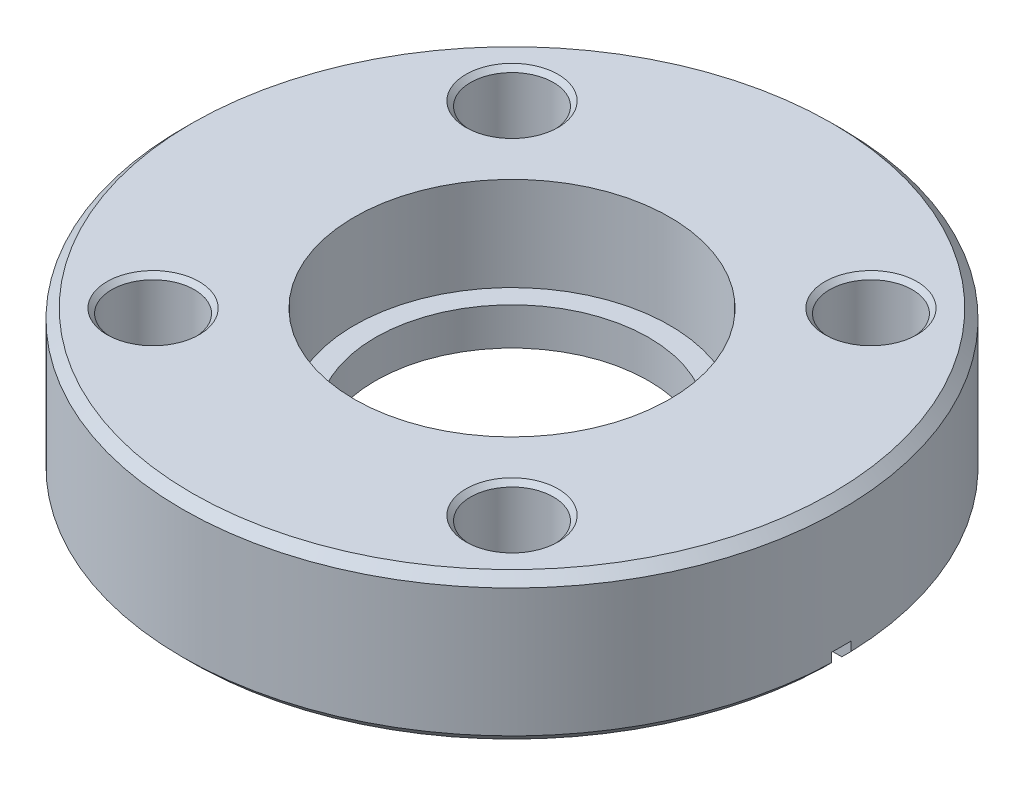
ISO-10303-21;
HEADER;
FILE_DESCRIPTION(('STEP AP214'),'2;1');
FILE_NAME('part.step','',(''),(''),'','','');
FILE_SCHEMA(('AUTOMOTIVE_DESIGN { 1 0 10303 214 1 1 1 1 }'));
ENDSEC;
DATA;
#1=APPLICATION_CONTEXT('core data for automotive mechanical design processes');
#2=APPLICATION_PROTOCOL_DEFINITION('international standard','automotive_design',2000,#1);
#3=PRODUCT_CONTEXT('',#1,'mechanical');
#4=PRODUCT('Part','Part','',(#3));
#5=PRODUCT_RELATED_PRODUCT_CATEGORY('part','',(#4));
#6=PRODUCT_DEFINITION_FORMATION('','',#4);
#7=PRODUCT_DEFINITION_CONTEXT('part definition',#1,'design');
#8=PRODUCT_DEFINITION('design','',#6,#7);
#9=PRODUCT_DEFINITION_SHAPE('','',#8);
#10=(LENGTH_UNIT() NAMED_UNIT(*) SI_UNIT(.MILLI.,.METRE.));
#11=(NAMED_UNIT(*) PLANE_ANGLE_UNIT() SI_UNIT($,.RADIAN.));
#12=(NAMED_UNIT(*) SI_UNIT($,.STERADIAN.) SOLID_ANGLE_UNIT());
#13=UNCERTAINTY_MEASURE_WITH_UNIT(LENGTH_MEASURE(1.E-05),#10,'distance_accuracy_value','');
#14=(GEOMETRIC_REPRESENTATION_CONTEXT(3) GLOBAL_UNCERTAINTY_ASSIGNED_CONTEXT((#13)) GLOBAL_UNIT_ASSIGNED_CONTEXT((#10,
#11,#12)) REPRESENTATION_CONTEXT('',''));
#15=CARTESIAN_POINT('',(0.,0.,0.));
#16=DIRECTION('',(0.,0.,1.));
#17=DIRECTION('',(1.,0.,0.));
#18=AXIS2_PLACEMENT_3D('',#15,#16,#17);
#19=CARTESIAN_POINT('',(0.,0.,0.));
#20=DIRECTION('',(0.,1.,0.));
#21=DIRECTION('',(0.,0.,1.));
#22=AXIS2_PLACEMENT_3D('',#19,#20,#21);
#23=PLANE('',#22);
#24=CARTESIAN_POINT('',(14.5929161967373,0.,-14.5929161967374));
#25=DIRECTION('',(0.,1.,0.));
#26=DIRECTION('',(0.,0.,1.));
#27=AXIS2_PLACEMENT_3D('',#24,#25,#26);
#28=CIRCLE('',#27,3.74649999999998);
#29=CARTESIAN_POINT('',(14.5929161967373,0.,-10.8464161967374));
#30=VERTEX_POINT('',#29);
#31=EDGE_CURVE('E154',#30,#30,#28,.T.);
#32=ORIENTED_EDGE('',*,*,#31,.T.);
#33=EDGE_LOOP('',(#32));
#34=FACE_BOUND('',#33,.T.);
#35=CARTESIAN_POINT('',(-14.5929161967372,0.,-14.5929161967375));
#36=DIRECTION('',(0.,1.,0.));
#37=DIRECTION('',(0.,0.,1.));
#38=AXIS2_PLACEMENT_3D('',#35,#36,#37);
#39=CIRCLE('',#38,3.74649999999998);
#40=CARTESIAN_POINT('',(-14.5929161967372,0.,-10.8464161967375));
#41=VERTEX_POINT('',#40);
#42=EDGE_CURVE('E190',#41,#41,#39,.T.);
#43=ORIENTED_EDGE('',*,*,#42,.T.);
#44=EDGE_LOOP('',(#43));
#45=FACE_BOUND('',#44,.T.);
#46=DIRECTION('',(-1.,0.,0.));
#47=VECTOR('',#46,1.);
#48=CARTESIAN_POINT('',(28.575,0.,-0.79375));
#49=LINE('',#48,#47);
#50=CARTESIAN_POINT('',(26.0228973394105,0.,-0.79375));
#51=VERTEX_POINT('',#50);
#52=CARTESIAN_POINT('',(16.4909084327547,0.,-0.79375));
#53=VERTEX_POINT('',#52);
#54=EDGE_CURVE('E216',#51,#53,#49,.T.);
#55=ORIENTED_EDGE('',*,*,#54,.T.);
#56=CARTESIAN_POINT('',(0.,0.,0.));
#57=DIRECTION('',(0.,1.,0.));
#58=DIRECTION('',(0.,0.,1.));
#59=AXIS2_PLACEMENT_3D('',#56,#57,#58);
#60=CIRCLE('',#59,16.51);
#61=CARTESIAN_POINT('',(-16.4909084327547,0.,-0.79375));
#62=VERTEX_POINT('',#61);
#63=EDGE_CURVE('E221',#53,#62,#60,.T.);
#64=ORIENTED_EDGE('',*,*,#63,.T.);
#65=DIRECTION('',(1.,0.,0.));
#66=VECTOR('',#65,1.);
#67=CARTESIAN_POINT('',(-28.575,0.,-0.79375));
#68=LINE('',#67,#66);
#69=CARTESIAN_POINT('',(-26.0228973394105,0.,-0.79375));
#70=VERTEX_POINT('',#69);
#71=EDGE_CURVE('E295',#70,#62,#68,.T.);
#72=ORIENTED_EDGE('',*,*,#71,.F.);
#73=CARTESIAN_POINT('',(0.,0.,0.));
#74=DIRECTION('',(0.,1.,0.));
#75=DIRECTION('',(0.,0.,1.));
#76=AXIS2_PLACEMENT_3D('',#73,#74,#75);
#77=CIRCLE('',#76,26.035);
#78=EDGE_CURVE('E131',#70,#51,#77,.F.);
#79=ORIENTED_EDGE('',*,*,#78,.T.);
#80=EDGE_LOOP('',(#55,#64,#72,#79));
#81=FACE_BOUND('',#80,.T.);
#82=ADVANCED_FACE('F33',(#34,#45,#81),#23,.F.);
#83=CARTESIAN_POINT('',(0.,11.938,0.));
#84=DIRECTION('',(0.,-1.,0.));
#85=DIRECTION('',(0.,0.,-1.));
#86=AXIS2_PLACEMENT_3D('',#83,#84,#85);
#87=CYLINDRICAL_SURFACE('',#86,26.797);
#88=CARTESIAN_POINT('',(0.,11.176,0.));
#89=DIRECTION('',(0.,1.,0.));
#90=DIRECTION('',(0.,0.,1.));
#91=AXIS2_PLACEMENT_3D('',#88,#89,#90);
#92=CIRCLE('',#91,26.797);
#93=CARTESIAN_POINT('',(0.,11.176,26.797));
#94=VERTEX_POINT('',#93);
#95=EDGE_CURVE('E132',#94,#94,#92,.F.);
#96=ORIENTED_EDGE('',*,*,#95,.T.);
#97=EDGE_LOOP('',(#96));
#98=FACE_BOUND('',#97,.T.);
#99=DIRECTION('',(0.,-1.,0.));
#100=VECTOR('',#99,1.);
#101=CARTESIAN_POINT('',(26.7852416441872,11.938,-0.79375));
#102=LINE('',#101,#100);
#103=CARTESIAN_POINT('',(26.7852416441872,0.762000000000009,-0.79375));
#104=VERTEX_POINT('',#103);
#105=CARTESIAN_POINT('',(26.7852416441872,1.5037550321313,-0.79375));
#106=VERTEX_POINT('',#105);
#107=EDGE_CURVE('E215',#104,#106,#102,.F.);
#108=ORIENTED_EDGE('',*,*,#107,.F.);
#109=CARTESIAN_POINT('',(0.,0.762000000000009,0.));
#110=DIRECTION('',(0.,1.,0.));
#111=DIRECTION('',(0.,0.,1.));
#112=AXIS2_PLACEMENT_3D('',#109,#110,#111);
#113=CIRCLE('',#112,26.797);
#114=CARTESIAN_POINT('',(-26.7852416441872,0.762000000000009,-0.79375));
#115=VERTEX_POINT('',#114);
#116=EDGE_CURVE('E250',#104,#115,#113,.T.);
#117=ORIENTED_EDGE('',*,*,#116,.T.);
#118=DIRECTION('',(0.,-1.,0.));
#119=VECTOR('',#118,1.);
#120=CARTESIAN_POINT('',(-26.7852416441872,11.938,-0.79375));
#121=LINE('',#120,#119);
#122=CARTESIAN_POINT('',(-26.7852416441872,1.5037550321313,-0.79375));
#123=VERTEX_POINT('',#122);
#124=EDGE_CURVE('E229',#123,#115,#121,.T.);
#125=ORIENTED_EDGE('',*,*,#124,.F.);
#126=CARTESIAN_POINT('',(0.,0.100000000000001,0.));
#127=DIRECTION('',(0.0523359562429369,0.998629534754574,0.));
#128=DIRECTION('',(0.998629534754574,-0.0523359562429369,0.));
#129=AXIS2_PLACEMENT_3D('',#126,#127,#128);
#130=ELLIPSE('',#129,26.8337747557063,26.797);
#131=CARTESIAN_POINT('',(-26.7852416441872,1.5037550321313,0.79375));
#132=VERTEX_POINT('',#131);
#133=EDGE_CURVE('E225',#123,#132,#130,.T.);
#134=ORIENTED_EDGE('',*,*,#133,.T.);
#135=DIRECTION('',(0.,-1.,0.));
#136=VECTOR('',#135,1.);
#137=CARTESIAN_POINT('',(-26.7852416441872,11.938,0.79375));
#138=LINE('',#137,#136);
#139=CARTESIAN_POINT('',(-26.7852416441872,0.762000000000009,0.79375));
#140=VERTEX_POINT('',#139);
#141=EDGE_CURVE('E268',#132,#140,#138,.T.);
#142=ORIENTED_EDGE('',*,*,#141,.T.);
#143=CARTESIAN_POINT('',(26.7852416441872,0.762000000000009,0.79375));
#144=VERTEX_POINT('',#143);
#145=EDGE_CURVE('E137',#140,#144,#113,.T.);
#146=ORIENTED_EDGE('',*,*,#145,.T.);
#147=DIRECTION('',(0.,-1.,0.));
#148=VECTOR('',#147,1.);
#149=CARTESIAN_POINT('',(26.7852416441872,11.938,0.79375));
#150=LINE('',#149,#148);
#151=CARTESIAN_POINT('',(26.7852416441872,1.5037550321313,0.79375));
#152=VERTEX_POINT('',#151);
#153=EDGE_CURVE('E111',#144,#152,#150,.F.);
#154=ORIENTED_EDGE('',*,*,#153,.T.);
#155=CARTESIAN_POINT('',(0.,0.100000000000001,0.));
#156=DIRECTION('',(0.0523359562429369,-0.998629534754574,0.));
#157=DIRECTION('',(-0.998629534754574,-0.0523359562429369,0.));
#158=AXIS2_PLACEMENT_3D('',#155,#156,#157);
#159=ELLIPSE('',#158,26.8337747557063,26.797);
#160=EDGE_CURVE('E299',#106,#152,#159,.T.);
#161=ORIENTED_EDGE('',*,*,#160,.F.);
#162=EDGE_LOOP('',(#108,#117,#125,#134,#142,#146,#154,#161));
#163=FACE_BOUND('',#162,.T.);
#164=ADVANCED_FACE('F256',(#98,#163),#87,.T.);
#165=CARTESIAN_POINT('',(0.,0.762000000000009,0.));
#166=DIRECTION('',(0.,1.,0.));
#167=DIRECTION('',(0.,0.,1.));
#168=AXIS2_PLACEMENT_3D('',#165,#166,#167);
#169=CONICAL_SURFACE('',#168,26.797,0.785398163397448);
#170=ORIENTED_EDGE('',*,*,#116,.F.);
#171=CARTESIAN_POINT('',(39.9149252456313,13.8878167396395,-0.79375));
#172=CARTESIAN_POINT('',(37.582159761859,11.5555440292699,-0.79375));
#173=CARTESIAN_POINT('',(35.2493822391249,9.22328334262406,-0.79375));
#174=CARTESIAN_POINT('',(30.5836763697181,4.55891299162924,-0.79375));
#175=CARTESIAN_POINT('',(28.2507480230503,2.22680332727534,-0.79375));
#176=CARTESIAN_POINT('',(24.7511471509542,-1.2711528459973,-0.79375));
#177=CARTESIAN_POINT('',(23.5845787714105,-2.43710354668637,-0.79375));
#178=CARTESIAN_POINT('',(21.2513297124667,-4.76889255459092,-0.79375));
#179=CARTESIAN_POINT('',(20.0846490330679,-5.93473086180759,-0.79375));
#180=CARTESIAN_POINT('',(17.7511055469923,-8.26622530435412,-0.79375));
#181=CARTESIAN_POINT('',(16.5842427403078,-9.4318814396762,-0.79375));
#182=CARTESIAN_POINT('',(14.8336959470664,-11.1801127807525,-0.79375));
#183=CARTESIAN_POINT('',(14.2501382417058,-11.7628144278514,-0.79375));
#184=CARTESIAN_POINT('',(13.0828952616553,-12.9280899562256,-0.79375));
#185=CARTESIAN_POINT('',(12.499209986963,-13.5106638374985,-0.79375));
#186=CARTESIAN_POINT('',(11.9154392477067,-14.0931520890488,-0.79375));
#187=B_SPLINE_CURVE_WITH_KNOTS('',3,(#171,#172,#173,#174,#175,#176,#177,#178,#179,#180,#181,
#182,#183,#184,#185,#186),.UNSPECIFIED.,.F.,.F.,(4,2,2,2,2,2,2,4),(0.,9.89604050110058,
19.7920806788791,24.7401010236157,29.6881213157675,34.636141819117,37.1101521590487,
39.5841625457492),.UNSPECIFIED.);
#188=EDGE_CURVE('E304',#104,#51,#187,.T.);
#189=ORIENTED_EDGE('',*,*,#188,.T.);
#190=ORIENTED_EDGE('',*,*,#78,.F.);
#191=CARTESIAN_POINT('',(-11.9154392477067,-14.0931520890488,-0.79375));
#192=CARTESIAN_POINT('',(-12.740750209919,-13.2696385608477,-0.79375));
#193=CARTESIAN_POINT('',(-13.5659024189443,-12.4459659964157,-0.79375));
#194=CARTESIAN_POINT('',(-15.2159854278817,-10.7983991575438,-0.79375));
#195=CARTESIAN_POINT('',(-16.0409162277999,-9.9745048831101,-0.79375));
#196=CARTESIAN_POINT('',(-18.5155206624987,-7.5026340358,-0.79375));
#197=CARTESIAN_POINT('',(-20.1650063983311,-5.8544693729203,-0.79375));
#198=CARTESIAN_POINT('',(-22.4982950790642,-3.52271996580898,-0.79375));
#199=CARTESIAN_POINT('',(-23.1821944600167,-2.83923170875339,-0.79375));
#200=CARTESIAN_POINT('',(-24.5499601243066,-1.47222206639029,-0.79375));
#201=CARTESIAN_POINT('',(-25.2338264076436,-0.7887006810825,-0.79375));
#202=CARTESIAN_POINT('',(-28.2507476717933,2.22680382292,-0.79375));
#203=CARTESIAN_POINT('',(-30.583676302528,4.55891334785627,-0.79375));
#204=CARTESIAN_POINT('',(-35.2493825954805,9.22328327547987,-0.79375));
#205=CARTESIAN_POINT('',(-37.5821602577027,11.5555436781628,-0.79375));
#206=CARTESIAN_POINT('',(-39.9149252456313,13.8878167396395,-0.79375));
#207=B_SPLINE_CURVE_WITH_KNOTS('',3,(#191,#192,#193,#194,#195,#196,#197,#198,#199,#200,#201,
#202,#203,#204,#205,#206),.UNSPECIFIED.,.F.,.F.,(4,2,2,2,2,2,2,4),(0.,3.49768692743902,
6.9953737576488,13.9907471378377,16.8914144838097,19.7920818536681,29.688122338109,
39.5841625325472),.UNSPECIFIED.);
#208=EDGE_CURVE('E263',#70,#115,#207,.T.);
#209=ORIENTED_EDGE('',*,*,#208,.T.);
#210=EDGE_LOOP('',(#170,#189,#190,#209));
#211=FACE_BOUND('',#210,.T.);
#212=ADVANCED_FACE('F267',(#211),#169,.T.);
#213=CARTESIAN_POINT('',(0.,4.318,0.));
#214=DIRECTION('',(0.,1.,0.));
#215=DIRECTION('',(0.,0.,1.));
#216=AXIS2_PLACEMENT_3D('',#213,#214,#215);
#217=CYLINDRICAL_SURFACE('',#216,16.51);
#218=CARTESIAN_POINT('',(0.,1.2446,0.));
#219=DIRECTION('',(0.,1.,0.));
#220=DIRECTION('',(0.,0.,1.));
#221=AXIS2_PLACEMENT_3D('',#218,#219,#220);
#222=CIRCLE('',#221,16.51);
#223=CARTESIAN_POINT('',(0.,1.2446,16.51));
#224=VERTEX_POINT('',#223);
#225=EDGE_CURVE('E227',#224,#224,#222,.T.);
#226=ORIENTED_EDGE('',*,*,#225,.T.);
#227=EDGE_LOOP('',(#226));
#228=FACE_BOUND('',#227,.T.);
#229=DIRECTION('',(0.,1.,0.));
#230=VECTOR('',#229,1.);
#231=CARTESIAN_POINT('',(16.4909084327547,4.318,-0.79375));
#232=LINE('',#231,#230);
#233=CARTESIAN_POINT('',(16.4909084327547,0.964251889320538,-0.79375));
#234=VERTEX_POINT('',#233);
#235=EDGE_CURVE('E11',#234,#53,#232,.F.);
#236=ORIENTED_EDGE('',*,*,#235,.F.);
#237=CARTESIAN_POINT('',(0.,0.100000000000002,0.));
#238=DIRECTION('',(0.0523359562429369,-0.998629534754574,0.));
#239=DIRECTION('',(0.998629534754574,0.0523359562429369,0.));
#240=AXIS2_PLACEMENT_3D('',#237,#238,#239);
#241=ELLIPSE('',#240,16.5326574324257,16.51);
#242=CARTESIAN_POINT('',(16.4909084327547,0.964251889320538,0.79375));
#243=VERTEX_POINT('',#242);
#244=EDGE_CURVE('E41',#243,#234,#241,.F.);
#245=ORIENTED_EDGE('',*,*,#244,.F.);
#246=DIRECTION('',(0.,1.,0.));
#247=VECTOR('',#246,1.);
#248=CARTESIAN_POINT('',(16.4909084327547,4.318,0.79375));
#249=LINE('',#248,#247);
#250=CARTESIAN_POINT('',(16.4909084327547,0.,0.79375));
#251=VERTEX_POINT('',#250);
#252=EDGE_CURVE('E201',#243,#251,#249,.F.);
#253=ORIENTED_EDGE('',*,*,#252,.T.);
#254=CARTESIAN_POINT('',(-16.4909084327547,0.,0.79375));
#255=VERTEX_POINT('',#254);
#256=EDGE_CURVE('E125',#255,#251,#60,.T.);
#257=ORIENTED_EDGE('',*,*,#256,.F.);
#258=DIRECTION('',(0.,1.,0.));
#259=VECTOR('',#258,1.);
#260=CARTESIAN_POINT('',(-16.4909084327547,4.318,0.79375));
#261=LINE('',#260,#259);
#262=CARTESIAN_POINT('',(-16.4909084327547,0.964251889320538,0.79375));
#263=VERTEX_POINT('',#262);
#264=EDGE_CURVE('E193',#255,#263,#261,.T.);
#265=ORIENTED_EDGE('',*,*,#264,.T.);
#266=CARTESIAN_POINT('',(0.,0.100000000000002,0.));
#267=DIRECTION('',(0.0523359562429369,0.998629534754574,0.));
#268=DIRECTION('',(-0.998629534754574,0.0523359562429369,0.));
#269=AXIS2_PLACEMENT_3D('',#266,#267,#268);
#270=ELLIPSE('',#269,16.5326574324257,16.51);
#271=CARTESIAN_POINT('',(-16.4909084327547,0.964251889320538,-0.79375));
#272=VERTEX_POINT('',#271);
#273=EDGE_CURVE('E196',#263,#272,#270,.F.);
#274=ORIENTED_EDGE('',*,*,#273,.T.);
#275=DIRECTION('',(0.,1.,0.));
#276=VECTOR('',#275,1.);
#277=CARTESIAN_POINT('',(-16.4909084327547,4.318,-0.79375));
#278=LINE('',#277,#276);
#279=EDGE_CURVE('E199',#62,#272,#278,.T.);
#280=ORIENTED_EDGE('',*,*,#279,.F.);
#281=ORIENTED_EDGE('',*,*,#63,.F.);
#282=EDGE_LOOP('',(#236,#245,#253,#257,#265,#274,#280,#281));
#283=FACE_BOUND('',#282,.T.);
#284=ADVANCED_FACE('F219',(#228,#283),#217,.F.);
#285=CARTESIAN_POINT('',(14.5929161967373,0.,14.5929161967374));
#286=DIRECTION('',(0.,1.,0.));
#287=DIRECTION('',(0.,0.,1.));
#288=AXIS2_PLACEMENT_3D('',#285,#286,#287);
#289=CIRCLE('',#288,3.74649999999998);
#290=CARTESIAN_POINT('',(14.5929161967373,0.,18.3394161967374));
#291=VERTEX_POINT('',#290);
#292=EDGE_CURVE('E166',#291,#291,#289,.T.);
#293=ORIENTED_EDGE('',*,*,#292,.T.);
#294=EDGE_LOOP('',(#293));
#295=FACE_BOUND('',#294,.T.);
#296=CARTESIAN_POINT('',(-14.5929161967373,0.,14.5929161967374));
#297=DIRECTION('',(0.,1.,0.));
#298=DIRECTION('',(0.,0.,1.));
#299=AXIS2_PLACEMENT_3D('',#296,#297,#298);
#300=CIRCLE('',#299,3.74649999999998);
#301=CARTESIAN_POINT('',(-14.5929161967373,0.,18.3394161967374));
#302=VERTEX_POINT('',#301);
#303=EDGE_CURVE('E178',#302,#302,#300,.T.);
#304=ORIENTED_EDGE('',*,*,#303,.T.);
#305=EDGE_LOOP('',(#304));
#306=FACE_BOUND('',#305,.T.);
#307=ORIENTED_EDGE('',*,*,#256,.T.);
#308=DIRECTION('',(-1.,0.,0.));
#309=VECTOR('',#308,1.);
#310=CARTESIAN_POINT('',(28.575,0.,0.79375));
#311=LINE('',#310,#309);
#312=CARTESIAN_POINT('',(26.0228973394105,0.,0.79375));
#313=VERTEX_POINT('',#312);
#314=EDGE_CURVE('E48',#313,#251,#311,.T.);
#315=ORIENTED_EDGE('',*,*,#314,.F.);
#316=CARTESIAN_POINT('',(-26.0228973394105,0.,0.79375));
#317=VERTEX_POINT('',#316);
#318=EDGE_CURVE('E122',#313,#317,#77,.F.);
#319=ORIENTED_EDGE('',*,*,#318,.T.);
#320=DIRECTION('',(1.,0.,0.));
#321=VECTOR('',#320,1.);
#322=CARTESIAN_POINT('',(-28.575,0.,0.79375));
#323=LINE('',#322,#321);
#324=EDGE_CURVE('E296',#317,#255,#323,.T.);
#325=ORIENTED_EDGE('',*,*,#324,.T.);
#326=EDGE_LOOP('',(#307,#315,#319,#325));
#327=FACE_BOUND('',#326,.T.);
#328=ADVANCED_FACE('F120',(#295,#306,#327),#23,.F.);
#329=CARTESIAN_POINT('',(39.9149252456313,13.8878167396395,0.79375));
#330=CARTESIAN_POINT('',(37.582159761859,11.5555440292699,0.79375));
#331=CARTESIAN_POINT('',(35.2493822391249,9.22328334262406,0.79375));
#332=CARTESIAN_POINT('',(30.5836763697181,4.55891299162924,0.79375));
#333=CARTESIAN_POINT('',(28.2507480230503,2.22680332727534,0.79375));
#334=CARTESIAN_POINT('',(24.7511471509542,-1.2711528459973,0.79375));
#335=CARTESIAN_POINT('',(23.5845787714105,-2.43710354668637,0.79375));
#336=CARTESIAN_POINT('',(21.2513297124667,-4.76889255459092,0.79375));
#337=CARTESIAN_POINT('',(20.0846490330679,-5.93473086180759,0.79375));
#338=CARTESIAN_POINT('',(17.7511055469923,-8.26622530435412,0.79375));
#339=CARTESIAN_POINT('',(16.5842427403078,-9.4318814396762,0.79375));
#340=CARTESIAN_POINT('',(14.8336959470664,-11.1801127807525,0.79375));
#341=CARTESIAN_POINT('',(14.2501382417058,-11.7628144278514,0.79375));
#342=CARTESIAN_POINT('',(13.0828952616553,-12.9280899562256,0.79375));
#343=CARTESIAN_POINT('',(12.499209986963,-13.5106638374985,0.79375));
#344=CARTESIAN_POINT('',(11.9154392477067,-14.0931520890488,0.79375));
#345=B_SPLINE_CURVE_WITH_KNOTS('',3,(#329,#330,#331,#332,#333,#334,#335,#336,#337,#338,#339,
#340,#341,#342,#343,#344),.UNSPECIFIED.,.F.,.F.,(4,2,2,2,2,2,2,4),(0.,9.89604050110058,
19.7920806788791,24.7401010236157,29.6881213157675,34.636141819117,37.1101521590487,
39.5841625457492),.UNSPECIFIED.);
#346=EDGE_CURVE('E107',#144,#313,#345,.T.);
#347=ORIENTED_EDGE('',*,*,#346,.F.);
#348=ORIENTED_EDGE('',*,*,#145,.F.);
#349=CARTESIAN_POINT('',(-11.9154392477067,-14.0931520890488,0.79375));
#350=CARTESIAN_POINT('',(-12.740750209919,-13.2696385608477,0.79375));
#351=CARTESIAN_POINT('',(-13.5659024189443,-12.4459659964157,0.79375));
#352=CARTESIAN_POINT('',(-15.2159854278817,-10.7983991575438,0.79375));
#353=CARTESIAN_POINT('',(-16.0409162277999,-9.9745048831101,0.79375));
#354=CARTESIAN_POINT('',(-18.5155206624987,-7.5026340358,0.79375));
#355=CARTESIAN_POINT('',(-20.1650063983311,-5.8544693729203,0.79375));
#356=CARTESIAN_POINT('',(-22.4982950790642,-3.52271996580898,0.79375));
#357=CARTESIAN_POINT('',(-23.1821944600167,-2.83923170875339,0.79375));
#358=CARTESIAN_POINT('',(-24.5499601243066,-1.47222206639029,0.79375));
#359=CARTESIAN_POINT('',(-25.2338264076436,-0.7887006810825,0.79375));
#360=CARTESIAN_POINT('',(-28.2507476717933,2.22680382292,0.79375));
#361=CARTESIAN_POINT('',(-30.583676302528,4.55891334785627,0.79375));
#362=CARTESIAN_POINT('',(-35.2493825954805,9.22328327547987,0.79375));
#363=CARTESIAN_POINT('',(-37.5821602577027,11.5555436781628,0.79375));
#364=CARTESIAN_POINT('',(-39.9149252456313,13.8878167396395,0.79375));
#365=B_SPLINE_CURVE_WITH_KNOTS('',3,(#349,#350,#351,#352,#353,#354,#355,#356,#357,#358,#359,
#360,#361,#362,#363,#364),.UNSPECIFIED.,.F.,.F.,(4,2,2,2,2,2,2,4),(0.,3.49768692743902,
6.9953737576488,13.9907471378377,16.8914144838097,19.7920818536681,29.688122338109,
39.5841625325472),.UNSPECIFIED.);
#366=EDGE_CURVE('E130',#317,#140,#365,.T.);
#367=ORIENTED_EDGE('',*,*,#366,.F.);
#368=ORIENTED_EDGE('',*,*,#318,.F.);
#369=EDGE_LOOP('',(#347,#348,#367,#368));
#370=FACE_BOUND('',#369,.T.);
#371=ADVANCED_FACE('F129',(#370),#169,.T.);
#372=CARTESIAN_POINT('',(0.,11.938,0.));
#373=DIRECTION('',(0.,1.,0.));
#374=DIRECTION('',(0.,0.,1.));
#375=AXIS2_PLACEMENT_3D('',#372,#373,#374);
#376=PLANE('',#375);
#377=CARTESIAN_POINT('',(-14.5929161967372,11.938,-14.5929161967375));
#378=DIRECTION('',(0.,1.,0.));
#379=DIRECTION('',(0.,0.,1.));
#380=AXIS2_PLACEMENT_3D('',#377,#378,#379);
#381=CIRCLE('',#380,3.7465);
#382=CARTESIAN_POINT('',(-14.5929161967372,11.938,-10.8464161967375));
#383=VERTEX_POINT('',#382);
#384=EDGE_CURVE('E187',#383,#383,#381,.F.);
#385=ORIENTED_EDGE('',*,*,#384,.T.);
#386=EDGE_LOOP('',(#385));
#387=FACE_BOUND('',#386,.T.);
#388=CARTESIAN_POINT('',(-14.5929161967373,11.938,14.5929161967374));
#389=DIRECTION('',(0.,1.,0.));
#390=DIRECTION('',(0.,0.,1.));
#391=AXIS2_PLACEMENT_3D('',#388,#389,#390);
#392=CIRCLE('',#391,3.7465);
#393=CARTESIAN_POINT('',(-14.5929161967373,11.938,18.3394161967374));
#394=VERTEX_POINT('',#393);
#395=EDGE_CURVE('E175',#394,#394,#392,.F.);
#396=ORIENTED_EDGE('',*,*,#395,.T.);
#397=EDGE_LOOP('',(#396));
#398=FACE_BOUND('',#397,.T.);
#399=CARTESIAN_POINT('',(14.5929161967373,11.938,14.5929161967374));
#400=DIRECTION('',(0.,1.,0.));
#401=DIRECTION('',(0.,0.,1.));
#402=AXIS2_PLACEMENT_3D('',#399,#400,#401);
#403=CIRCLE('',#402,3.74650000000002);
#404=CARTESIAN_POINT('',(14.5929161967373,11.938,18.3394161967374));
#405=VERTEX_POINT('',#404);
#406=EDGE_CURVE('E163',#405,#405,#403,.F.);
#407=ORIENTED_EDGE('',*,*,#406,.T.);
#408=EDGE_LOOP('',(#407));
#409=FACE_BOUND('',#408,.T.);
#410=CARTESIAN_POINT('',(0.,11.938,0.));
#411=DIRECTION('',(0.,1.,0.));
#412=DIRECTION('',(0.,0.,1.));
#413=AXIS2_PLACEMENT_3D('',#410,#411,#412);
#414=CIRCLE('',#413,26.035);
#415=CARTESIAN_POINT('',(0.,11.938,26.035));
#416=VERTEX_POINT('',#415);
#417=EDGE_CURVE('E248',#416,#416,#414,.T.);
#418=ORIENTED_EDGE('',*,*,#417,.T.);
#419=EDGE_LOOP('',(#418));
#420=FACE_BOUND('',#419,.T.);
#421=CARTESIAN_POINT('',(0.,11.938,0.));
#422=DIRECTION('',(0.,1.,0.));
#423=DIRECTION('',(0.,0.,1.));
#424=AXIS2_PLACEMENT_3D('',#421,#422,#423);
#425=CIRCLE('',#424,12.827);
#426=CARTESIAN_POINT('',(0.,11.938,12.827));
#427=VERTEX_POINT('',#426);
#428=EDGE_CURVE('E144',#427,#427,#425,.T.);
#429=ORIENTED_EDGE('',*,*,#428,.F.);
#430=EDGE_LOOP('',(#429));
#431=FACE_BOUND('',#430,.T.);
#432=CARTESIAN_POINT('',(14.5929161967373,11.938,-14.5929161967374));
#433=DIRECTION('',(0.,1.,0.));
#434=DIRECTION('',(0.,0.,1.));
#435=AXIS2_PLACEMENT_3D('',#432,#433,#434);
#436=CIRCLE('',#435,3.7465);
#437=CARTESIAN_POINT('',(14.5929161967373,11.938,-10.8464161967374));
#438=VERTEX_POINT('',#437);
#439=EDGE_CURVE('E151',#438,#438,#436,.F.);
#440=ORIENTED_EDGE('',*,*,#439,.T.);
#441=EDGE_LOOP('',(#440));
#442=FACE_BOUND('',#441,.T.);
#443=ADVANCED_FACE('F342',(#387,#398,#409,#420,#431,#442),#376,.T.);
#444=CARTESIAN_POINT('',(0.,11.938,0.));
#445=DIRECTION('',(0.,-1.,0.));
#446=DIRECTION('',(0.,0.,-1.));
#447=AXIS2_PLACEMENT_3D('',#444,#445,#446);
#448=CYLINDRICAL_SURFACE('',#447,11.1125);
#449=CARTESIAN_POINT('',(0.,1.27,0.));
#450=DIRECTION('',(0.,1.,0.));
#451=DIRECTION('',(0.,0.,1.));
#452=AXIS2_PLACEMENT_3D('',#449,#450,#451);
#453=CIRCLE('',#452,11.1125);
#454=CARTESIAN_POINT('',(0.,1.27,11.1125));
#455=VERTEX_POINT('',#454);
#456=EDGE_CURVE('E141',#455,#455,#453,.T.);
#457=ORIENTED_EDGE('',*,*,#456,.F.);
#458=EDGE_LOOP('',(#457));
#459=FACE_BOUND('',#458,.T.);
#460=CARTESIAN_POINT('',(0.,4.318,0.));
#461=DIRECTION('',(0.,1.,0.));
#462=DIRECTION('',(0.,0.,1.));
#463=AXIS2_PLACEMENT_3D('',#460,#461,#462);
#464=CIRCLE('',#463,11.1125);
#465=CARTESIAN_POINT('',(0.,4.318,11.1125));
#466=VERTEX_POINT('',#465);
#467=EDGE_CURVE('E243',#466,#466,#464,.T.);
#468=ORIENTED_EDGE('',*,*,#467,.T.);
#469=EDGE_LOOP('',(#468));
#470=FACE_BOUND('',#469,.T.);
#471=ADVANCED_FACE('F395',(#459,#470),#448,.F.);
#472=CARTESIAN_POINT('',(0.,4.318,0.));
#473=DIRECTION('',(0.,1.,0.));
#474=DIRECTION('',(0.,0.,1.));
#475=AXIS2_PLACEMENT_3D('',#472,#473,#474);
#476=CYLINDRICAL_SURFACE('',#475,12.827);
#477=CARTESIAN_POINT('',(0.,4.318,0.));
#478=DIRECTION('',(0.,1.,0.));
#479=DIRECTION('',(0.,0.,1.));
#480=AXIS2_PLACEMENT_3D('',#477,#478,#479);
#481=CIRCLE('',#480,12.827);
#482=CARTESIAN_POINT('',(0.,4.318,12.827));
#483=VERTEX_POINT('',#482);
#484=EDGE_CURVE('E240',#483,#483,#481,.T.);
#485=ORIENTED_EDGE('',*,*,#484,.F.);
#486=EDGE_LOOP('',(#485));
#487=FACE_BOUND('',#486,.T.);
#488=ORIENTED_EDGE('',*,*,#428,.T.);
#489=EDGE_LOOP('',(#488));
#490=FACE_BOUND('',#489,.T.);
#491=ADVANCED_FACE('F400',(#487,#490),#476,.F.);
#492=CARTESIAN_POINT('',(0.,4.318,0.));
#493=DIRECTION('',(0.,1.,0.));
#494=DIRECTION('',(0.,0.,1.));
#495=AXIS2_PLACEMENT_3D('',#492,#493,#494);
#496=PLANE('',#495);
#497=ORIENTED_EDGE('',*,*,#467,.F.);
#498=EDGE_LOOP('',(#497));
#499=FACE_BOUND('',#498,.T.);
#500=ORIENTED_EDGE('',*,*,#484,.T.);
#501=EDGE_LOOP('',(#500));
#502=FACE_BOUND('',#501,.T.);
#503=ADVANCED_FACE('F407',(#499,#502),#496,.T.);
#504=CARTESIAN_POINT('',(0.,11.938,0.));
#505=DIRECTION('',(0.,-1.,0.));
#506=DIRECTION('',(0.,0.,-1.));
#507=AXIS2_PLACEMENT_3D('',#504,#505,#506);
#508=CONICAL_SURFACE('',#507,26.035,0.785398163397444);
#509=ORIENTED_EDGE('',*,*,#95,.F.);
#510=EDGE_LOOP('',(#509));
#511=FACE_BOUND('',#510,.T.);
#512=ORIENTED_EDGE('',*,*,#417,.F.);
#513=EDGE_LOOP('',(#512));
#514=FACE_BOUND('',#513,.T.);
#515=ADVANCED_FACE('F411',(#511,#514),#508,.T.);
#516=CARTESIAN_POINT('',(-13.843,1.27,0.));
#517=DIRECTION('',(0.,1.,0.));
#518=DIRECTION('',(0.,0.,1.));
#519=AXIS2_PLACEMENT_3D('',#516,#517,#518);
#520=PLANE('',#519);
#521=ORIENTED_EDGE('',*,*,#456,.T.);
#522=EDGE_LOOP('',(#521));
#523=FACE_BOUND('',#522,.T.);
#524=CARTESIAN_POINT('',(0.,1.27,0.));
#525=DIRECTION('',(0.,1.,0.));
#526=DIRECTION('',(0.,0.,1.));
#527=AXIS2_PLACEMENT_3D('',#524,#525,#526);
#528=CIRCLE('',#527,13.843);
#529=CARTESIAN_POINT('',(0.,1.27,13.843));
#530=VERTEX_POINT('',#529);
#531=EDGE_CURVE('E145',#530,#530,#528,.T.);
#532=ORIENTED_EDGE('',*,*,#531,.F.);
#533=EDGE_LOOP('',(#532));
#534=FACE_BOUND('',#533,.T.);
#535=ADVANCED_FACE('F413',(#523,#534),#520,.F.);
#536=CARTESIAN_POINT('',(0.,4.318,0.));
#537=DIRECTION('',(0.,1.,0.));
#538=DIRECTION('',(0.,0.,1.));
#539=AXIS2_PLACEMENT_3D('',#536,#537,#538);
#540=CYLINDRICAL_SURFACE('',#539,13.843);
#541=CARTESIAN_POINT('',(0.,0.6604,0.));
#542=DIRECTION('',(0.,1.,0.));
#543=DIRECTION('',(0.,0.,1.));
#544=AXIS2_PLACEMENT_3D('',#541,#542,#543);
#545=CIRCLE('',#544,13.843);
#546=CARTESIAN_POINT('',(0.,0.6604,13.843));
#547=VERTEX_POINT('',#546);
#548=EDGE_CURVE('E235',#547,#547,#545,.T.);
#549=ORIENTED_EDGE('',*,*,#548,.F.);
#550=EDGE_LOOP('',(#549));
#551=FACE_BOUND('',#550,.T.);
#552=ORIENTED_EDGE('',*,*,#531,.T.);
#553=EDGE_LOOP('',(#552));
#554=FACE_BOUND('',#553,.T.);
#555=ADVANCED_FACE('F416',(#551,#554),#540,.F.);
#556=CARTESIAN_POINT('',(0.,0.6604,0.));
#557=DIRECTION('',(0.,1.,0.));
#558=DIRECTION('',(0.,0.,1.));
#559=AXIS2_PLACEMENT_3D('',#556,#557,#558);
#560=CONICAL_SURFACE('',#559,13.843,1.35515461688043);
#561=ORIENTED_EDGE('',*,*,#225,.F.);
#562=EDGE_LOOP('',(#561));
#563=FACE_BOUND('',#562,.T.);
#564=ORIENTED_EDGE('',*,*,#548,.T.);
#565=EDGE_LOOP('',(#564));
#566=FACE_BOUND('',#565,.T.);
#567=ADVANCED_FACE('F383',(#563,#566),#560,.T.);
#568=CARTESIAN_POINT('',(14.5929161967373,11.938,-14.5929161967374));
#569=DIRECTION('',(0.,-1.,0.));
#570=DIRECTION('',(0.,0.,-1.));
#571=AXIS2_PLACEMENT_3D('',#568,#569,#570);
#572=CYLINDRICAL_SURFACE('',#571,3.3655);
#573=CARTESIAN_POINT('',(14.5929161967373,11.557,-14.5929161967374));
#574=DIRECTION('',(0.,1.,0.));
#575=DIRECTION('',(0.,0.,1.));
#576=AXIS2_PLACEMENT_3D('',#573,#574,#575);
#577=CIRCLE('',#576,3.3655);
#578=CARTESIAN_POINT('',(14.5929161967373,11.557,-11.2274161967374));
#579=VERTEX_POINT('',#578);
#580=EDGE_CURVE('E148',#579,#579,#577,.T.);
#581=ORIENTED_EDGE('',*,*,#580,.T.);
#582=EDGE_LOOP('',(#581));
#583=FACE_BOUND('',#582,.T.);
#584=CARTESIAN_POINT('',(14.5929161967373,0.380999999999986,-14.5929161967374));
#585=DIRECTION('',(0.,1.,0.));
#586=DIRECTION('',(0.,0.,1.));
#587=AXIS2_PLACEMENT_3D('',#584,#585,#586);
#588=CIRCLE('',#587,3.3655);
#589=CARTESIAN_POINT('',(14.5929161967373,0.380999999999986,-11.2274161967374));
#590=VERTEX_POINT('',#589);
#591=EDGE_CURVE('E135',#590,#590,#588,.F.);
#592=ORIENTED_EDGE('',*,*,#591,.T.);
#593=EDGE_LOOP('',(#592));
#594=FACE_BOUND('',#593,.T.);
#595=ADVANCED_FACE('F378',(#583,#594),#572,.F.);
#596=CARTESIAN_POINT('',(14.5929161967373,11.557,-14.5929161967374));
#597=DIRECTION('',(0.,1.,0.));
#598=DIRECTION('',(0.,0.,1.));
#599=AXIS2_PLACEMENT_3D('',#596,#597,#598);
#600=CONICAL_SURFACE('',#599,3.3655,0.785398163397448);
#601=ORIENTED_EDGE('',*,*,#439,.F.);
#602=EDGE_LOOP('',(#601));
#603=FACE_BOUND('',#602,.T.);
#604=ORIENTED_EDGE('',*,*,#580,.F.);
#605=EDGE_LOOP('',(#604));
#606=FACE_BOUND('',#605,.T.);
#607=ADVANCED_FACE('F375',(#603,#606),#600,.F.);
#608=CARTESIAN_POINT('',(14.5929161967373,0.,-14.5929161967374));
#609=DIRECTION('',(0.,-1.,0.));
#610=DIRECTION('',(0.,0.,-1.));
#611=AXIS2_PLACEMENT_3D('',#608,#609,#610);
#612=CONICAL_SURFACE('',#611,3.74649999999998,0.785398163397448);
#613=ORIENTED_EDGE('',*,*,#591,.F.);
#614=EDGE_LOOP('',(#613));
#615=FACE_BOUND('',#614,.T.);
#616=ORIENTED_EDGE('',*,*,#31,.F.);
#617=EDGE_LOOP('',(#616));
#618=FACE_BOUND('',#617,.T.);
#619=ADVANCED_FACE('F372',(#615,#618),#612,.F.);
#620=CARTESIAN_POINT('',(14.5929161967373,11.938,14.5929161967374));
#621=DIRECTION('',(0.,-1.,0.));
#622=DIRECTION('',(0.,0.,-1.));
#623=AXIS2_PLACEMENT_3D('',#620,#621,#622);
#624=CYLINDRICAL_SURFACE('',#623,3.3655);
#625=CARTESIAN_POINT('',(14.5929161967373,11.557,14.5929161967374));
#626=DIRECTION('',(0.,1.,0.));
#627=DIRECTION('',(0.,0.,1.));
#628=AXIS2_PLACEMENT_3D('',#625,#626,#627);
#629=CIRCLE('',#628,3.3655);
#630=CARTESIAN_POINT('',(14.5929161967373,11.557,17.9584161967374));
#631=VERTEX_POINT('',#630);
#632=EDGE_CURVE('E160',#631,#631,#629,.T.);
#633=ORIENTED_EDGE('',*,*,#632,.T.);
#634=EDGE_LOOP('',(#633));
#635=FACE_BOUND('',#634,.T.);
#636=CARTESIAN_POINT('',(14.5929161967373,0.380999999999986,14.5929161967374));
#637=DIRECTION('',(0.,1.,0.));
#638=DIRECTION('',(0.,0.,1.));
#639=AXIS2_PLACEMENT_3D('',#636,#637,#638);
#640=CIRCLE('',#639,3.3655);
#641=CARTESIAN_POINT('',(14.5929161967373,0.380999999999986,17.9584161967374));
#642=VERTEX_POINT('',#641);
#643=EDGE_CURVE('E157',#642,#642,#640,.F.);
#644=ORIENTED_EDGE('',*,*,#643,.T.);
#645=EDGE_LOOP('',(#644));
#646=FACE_BOUND('',#645,.T.);
#647=ADVANCED_FACE('F374',(#635,#646),#624,.F.);
#648=CARTESIAN_POINT('',(-14.5929161967373,11.938,14.5929161967374));
#649=DIRECTION('',(0.,-1.,0.));
#650=DIRECTION('',(0.,0.,-1.));
#651=AXIS2_PLACEMENT_3D('',#648,#649,#650);
#652=CYLINDRICAL_SURFACE('',#651,3.3655);
#653=CARTESIAN_POINT('',(-14.5929161967373,11.557,14.5929161967374));
#654=DIRECTION('',(0.,1.,0.));
#655=DIRECTION('',(0.,0.,1.));
#656=AXIS2_PLACEMENT_3D('',#653,#654,#655);
#657=CIRCLE('',#656,3.3655);
#658=CARTESIAN_POINT('',(-14.5929161967373,11.557,17.9584161967374));
#659=VERTEX_POINT('',#658);
#660=EDGE_CURVE('E172',#659,#659,#657,.T.);
#661=ORIENTED_EDGE('',*,*,#660,.T.);
#662=EDGE_LOOP('',(#661));
#663=FACE_BOUND('',#662,.T.);
#664=CARTESIAN_POINT('',(-14.5929161967373,0.380999999999986,14.5929161967374));
#665=DIRECTION('',(0.,1.,0.));
#666=DIRECTION('',(0.,0.,1.));
#667=AXIS2_PLACEMENT_3D('',#664,#665,#666);
#668=CIRCLE('',#667,3.3655);
#669=CARTESIAN_POINT('',(-14.5929161967373,0.380999999999986,17.9584161967374));
#670=VERTEX_POINT('',#669);
#671=EDGE_CURVE('E169',#670,#670,#668,.F.);
#672=ORIENTED_EDGE('',*,*,#671,.T.);
#673=EDGE_LOOP('',(#672));
#674=FACE_BOUND('',#673,.T.);
#675=ADVANCED_FACE('F426',(#663,#674),#652,.F.);
#676=CARTESIAN_POINT('',(-14.5929161967372,11.938,-14.5929161967375));
#677=DIRECTION('',(0.,-1.,0.));
#678=DIRECTION('',(0.,0.,-1.));
#679=AXIS2_PLACEMENT_3D('',#676,#677,#678);
#680=CYLINDRICAL_SURFACE('',#679,3.3655);
#681=CARTESIAN_POINT('',(-14.5929161967372,11.557,-14.5929161967375));
#682=DIRECTION('',(0.,1.,0.));
#683=DIRECTION('',(0.,0.,1.));
#684=AXIS2_PLACEMENT_3D('',#681,#682,#683);
#685=CIRCLE('',#684,3.3655);
#686=CARTESIAN_POINT('',(-14.5929161967372,11.557,-11.2274161967375));
#687=VERTEX_POINT('',#686);
#688=EDGE_CURVE('E184',#687,#687,#685,.T.);
#689=ORIENTED_EDGE('',*,*,#688,.T.);
#690=EDGE_LOOP('',(#689));
#691=FACE_BOUND('',#690,.T.);
#692=CARTESIAN_POINT('',(-14.5929161967372,0.380999999999986,-14.5929161967375));
#693=DIRECTION('',(0.,1.,0.));
#694=DIRECTION('',(0.,0.,1.));
#695=AXIS2_PLACEMENT_3D('',#692,#693,#694);
#696=CIRCLE('',#695,3.3655);
#697=CARTESIAN_POINT('',(-14.5929161967372,0.380999999999986,-11.2274161967375));
#698=VERTEX_POINT('',#697);
#699=EDGE_CURVE('E181',#698,#698,#696,.F.);
#700=ORIENTED_EDGE('',*,*,#699,.T.);
#701=EDGE_LOOP('',(#700));
#702=FACE_BOUND('',#701,.T.);
#703=ADVANCED_FACE('F370',(#691,#702),#680,.F.);
#704=CARTESIAN_POINT('',(14.5929161967373,11.557,14.5929161967374));
#705=DIRECTION('',(0.,1.,0.));
#706=DIRECTION('',(0.,0.,1.));
#707=AXIS2_PLACEMENT_3D('',#704,#705,#706);
#708=CONICAL_SURFACE('',#707,3.3655,0.785398163397446);
#709=ORIENTED_EDGE('',*,*,#406,.F.);
#710=EDGE_LOOP('',(#709));
#711=FACE_BOUND('',#710,.T.);
#712=ORIENTED_EDGE('',*,*,#632,.F.);
#713=EDGE_LOOP('',(#712));
#714=FACE_BOUND('',#713,.T.);
#715=ADVANCED_FACE('F366',(#711,#714),#708,.F.);
#716=CARTESIAN_POINT('',(14.5929161967373,0.,14.5929161967374));
#717=DIRECTION('',(0.,-1.,0.));
#718=DIRECTION('',(0.,0.,-1.));
#719=AXIS2_PLACEMENT_3D('',#716,#717,#718);
#720=CONICAL_SURFACE('',#719,3.74649999999998,0.785398163397446);
#721=ORIENTED_EDGE('',*,*,#643,.F.);
#722=EDGE_LOOP('',(#721));
#723=FACE_BOUND('',#722,.T.);
#724=ORIENTED_EDGE('',*,*,#292,.F.);
#725=EDGE_LOOP('',(#724));
#726=FACE_BOUND('',#725,.T.);
#727=ADVANCED_FACE('F359',(#723,#726),#720,.F.);
#728=CARTESIAN_POINT('',(-14.5929161967373,11.557,14.5929161967374));
#729=DIRECTION('',(0.,1.,0.));
#730=DIRECTION('',(0.,0.,1.));
#731=AXIS2_PLACEMENT_3D('',#728,#729,#730);
#732=CONICAL_SURFACE('',#731,3.3655,0.785398163397448);
#733=ORIENTED_EDGE('',*,*,#395,.F.);
#734=EDGE_LOOP('',(#733));
#735=FACE_BOUND('',#734,.T.);
#736=ORIENTED_EDGE('',*,*,#660,.F.);
#737=EDGE_LOOP('',(#736));
#738=FACE_BOUND('',#737,.T.);
#739=ADVANCED_FACE('F351',(#735,#738),#732,.F.);
#740=CARTESIAN_POINT('',(-14.5929161967373,0.,14.5929161967374));
#741=DIRECTION('',(0.,-1.,0.));
#742=DIRECTION('',(0.,0.,-1.));
#743=AXIS2_PLACEMENT_3D('',#740,#741,#742);
#744=CONICAL_SURFACE('',#743,3.74649999999998,0.785398163397448);
#745=ORIENTED_EDGE('',*,*,#671,.F.);
#746=EDGE_LOOP('',(#745));
#747=FACE_BOUND('',#746,.T.);
#748=ORIENTED_EDGE('',*,*,#303,.F.);
#749=EDGE_LOOP('',(#748));
#750=FACE_BOUND('',#749,.T.);
#751=ADVANCED_FACE('F349',(#747,#750),#744,.F.);
#752=CARTESIAN_POINT('',(-14.5929161967372,11.557,-14.5929161967375));
#753=DIRECTION('',(0.,1.,0.));
#754=DIRECTION('',(0.,0.,1.));
#755=AXIS2_PLACEMENT_3D('',#752,#753,#754);
#756=CONICAL_SURFACE('',#755,3.3655,0.785398163397448);
#757=ORIENTED_EDGE('',*,*,#384,.F.);
#758=EDGE_LOOP('',(#757));
#759=FACE_BOUND('',#758,.T.);
#760=ORIENTED_EDGE('',*,*,#688,.F.);
#761=EDGE_LOOP('',(#760));
#762=FACE_BOUND('',#761,.T.);
#763=ADVANCED_FACE('F324',(#759,#762),#756,.F.);
#764=CARTESIAN_POINT('',(-14.5929161967372,0.,-14.5929161967375));
#765=DIRECTION('',(0.,-1.,0.));
#766=DIRECTION('',(0.,0.,-1.));
#767=AXIS2_PLACEMENT_3D('',#764,#765,#766);
#768=CONICAL_SURFACE('',#767,3.74649999999998,0.785398163397448);
#769=ORIENTED_EDGE('',*,*,#699,.F.);
#770=EDGE_LOOP('',(#769));
#771=FACE_BOUND('',#770,.T.);
#772=ORIENTED_EDGE('',*,*,#42,.F.);
#773=EDGE_LOOP('',(#772));
#774=FACE_BOUND('',#773,.T.);
#775=ADVANCED_FACE('F35',(#771,#774),#768,.F.);
#776=CARTESIAN_POINT('',(-15.875,0.93197349611817,-0.79375));
#777=DIRECTION('',(0.0523359562429369,0.998629534754574,0.));
#778=DIRECTION('',(-0.998629534754574,0.0523359562429369,0.));
#779=AXIS2_PLACEMENT_3D('',#776,#777,#778);
#780=PLANE('',#779);
#781=DIRECTION('',(-0.998629534754574,0.0523359562429369,0.));
#782=VECTOR('',#781,1.);
#783=CARTESIAN_POINT('',(-15.875,0.93197349611817,-0.79375));
#784=LINE('',#783,#782);
#785=EDGE_CURVE('E265',#272,#123,#784,.T.);
#786=ORIENTED_EDGE('',*,*,#785,.F.);
#787=ORIENTED_EDGE('',*,*,#273,.F.);
#788=DIRECTION('',(-0.998629534754574,0.0523359562429369,0.));
#789=VECTOR('',#788,1.);
#790=CARTESIAN_POINT('',(-15.875,0.93197349611817,0.79375));
#791=LINE('',#790,#789);
#792=EDGE_CURVE('E56',#263,#132,#791,.T.);
#793=ORIENTED_EDGE('',*,*,#792,.T.);
#794=ORIENTED_EDGE('',*,*,#133,.F.);
#795=EDGE_LOOP('',(#786,#787,#793,#794));
#796=FACE_BOUND('',#795,.T.);
#797=ADVANCED_FACE('F285',(#796),#780,.F.);
#798=CARTESIAN_POINT('',(0.,0.,-0.79375));
#799=DIRECTION('',(0.,0.,1.));
#800=DIRECTION('',(1.,0.,0.));
#801=AXIS2_PLACEMENT_3D('',#798,#799,#800);
#802=PLANE('',#801);
#803=ORIENTED_EDGE('',*,*,#124,.T.);
#804=ORIENTED_EDGE('',*,*,#208,.F.);
#805=ORIENTED_EDGE('',*,*,#71,.T.);
#806=ORIENTED_EDGE('',*,*,#279,.T.);
#807=ORIENTED_EDGE('',*,*,#785,.T.);
#808=EDGE_LOOP('',(#803,#804,#805,#806,#807));
#809=FACE_BOUND('',#808,.T.);
#810=ADVANCED_FACE('F262',(#809),#802,.T.);
#811=CARTESIAN_POINT('',(0.,0.,0.79375));
#812=DIRECTION('',(0.,0.,1.));
#813=DIRECTION('',(1.,0.,0.));
#814=AXIS2_PLACEMENT_3D('',#811,#812,#813);
#815=PLANE('',#814);
#816=ORIENTED_EDGE('',*,*,#792,.F.);
#817=ORIENTED_EDGE('',*,*,#264,.F.);
#818=ORIENTED_EDGE('',*,*,#324,.F.);
#819=ORIENTED_EDGE('',*,*,#366,.T.);
#820=ORIENTED_EDGE('',*,*,#141,.F.);
#821=EDGE_LOOP('',(#816,#817,#818,#819,#820));
#822=FACE_BOUND('',#821,.T.);
#823=ADVANCED_FACE('F284',(#822),#815,.F.);
#824=CARTESIAN_POINT('',(15.875,0.93197349611817,-0.79375));
#825=DIRECTION('',(0.0523359562429369,-0.998629534754574,0.));
#826=DIRECTION('',(0.998629534754574,0.0523359562429369,0.));
#827=AXIS2_PLACEMENT_3D('',#824,#825,#826);
#828=PLANE('',#827);
#829=ORIENTED_EDGE('',*,*,#160,.T.);
#830=DIRECTION('',(0.998629534754574,0.0523359562429369,0.));
#831=VECTOR('',#830,1.);
#832=CARTESIAN_POINT('',(15.875,0.93197349611817,0.79375));
#833=LINE('',#832,#831);
#834=EDGE_CURVE('E126',#243,#152,#833,.T.);
#835=ORIENTED_EDGE('',*,*,#834,.F.);
#836=ORIENTED_EDGE('',*,*,#244,.T.);
#837=DIRECTION('',(0.998629534754574,0.0523359562429369,0.));
#838=VECTOR('',#837,1.);
#839=CARTESIAN_POINT('',(15.875,0.93197349611817,-0.79375));
#840=LINE('',#839,#838);
#841=EDGE_CURVE('E116',#234,#106,#840,.T.);
#842=ORIENTED_EDGE('',*,*,#841,.T.);
#843=EDGE_LOOP('',(#829,#835,#836,#842));
#844=FACE_BOUND('',#843,.T.);
#845=ADVANCED_FACE('F207',(#844),#828,.T.);
#846=CARTESIAN_POINT('',(0.,0.,-0.79375));
#847=DIRECTION('',(0.,0.,1.));
#848=DIRECTION('',(-1.,0.,0.));
#849=AXIS2_PLACEMENT_3D('',#846,#847,#848);
#850=PLANE('',#849);
#851=ORIENTED_EDGE('',*,*,#107,.T.);
#852=ORIENTED_EDGE('',*,*,#841,.F.);
#853=ORIENTED_EDGE('',*,*,#235,.T.);
#854=ORIENTED_EDGE('',*,*,#54,.F.);
#855=ORIENTED_EDGE('',*,*,#188,.F.);
#856=EDGE_LOOP('',(#851,#852,#853,#854,#855));
#857=FACE_BOUND('',#856,.T.);
#858=ADVANCED_FACE('F212',(#857),#850,.T.);
#859=CARTESIAN_POINT('',(0.,0.,0.79375));
#860=DIRECTION('',(0.,0.,1.));
#861=DIRECTION('',(-1.,0.,0.));
#862=AXIS2_PLACEMENT_3D('',#859,#860,#861);
#863=PLANE('',#862);
#864=ORIENTED_EDGE('',*,*,#346,.T.);
#865=ORIENTED_EDGE('',*,*,#314,.T.);
#866=ORIENTED_EDGE('',*,*,#252,.F.);
#867=ORIENTED_EDGE('',*,*,#834,.T.);
#868=ORIENTED_EDGE('',*,*,#153,.F.);
#869=EDGE_LOOP('',(#864,#865,#866,#867,#868));
#870=FACE_BOUND('',#869,.T.);
#871=ADVANCED_FACE('F108',(#870),#863,.F.);
#872=CLOSED_SHELL('',(#82,#164,#212,#284,#328,#371,#443,#471,#491,#503,#515,#535,#555,#567,#595,
#607,#619,#647,#675,#703,#715,#727,#739,#751,#763,#775,#797,#810,#823,#845,#858,#871));
#873=MANIFOLD_SOLID_BREP('B2',#872);
#874=ADVANCED_BREP_SHAPE_REPRESENTATION('',(#18,#873),#14);
#875=SHAPE_DEFINITION_REPRESENTATION(#9,#874);
ENDSEC;
END-ISO-10303-21;
